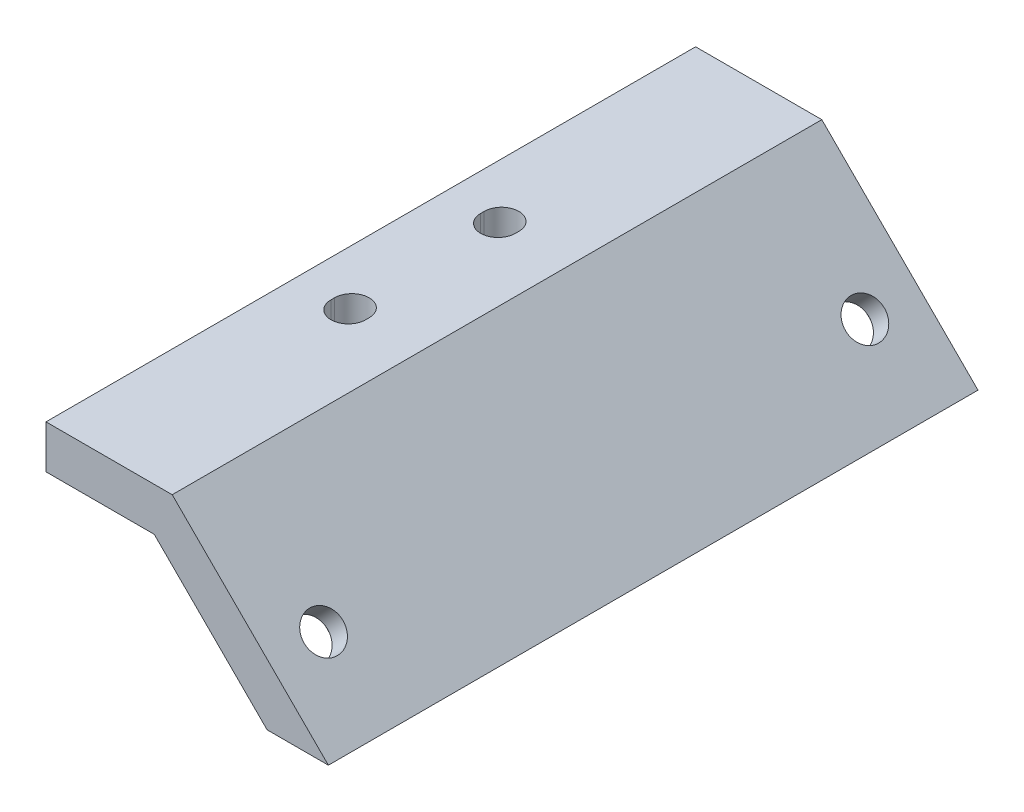
ISO-10303-21;
HEADER;
FILE_DESCRIPTION(('STEP AP214'),'2;1');
FILE_NAME('part.step','',(''),(''),'','','');
FILE_SCHEMA(('AUTOMOTIVE_DESIGN { 1 0 10303 214 1 1 1 1 }'));
ENDSEC;
DATA;
#1=APPLICATION_CONTEXT('core data for automotive mechanical design processes');
#2=APPLICATION_PROTOCOL_DEFINITION('international standard','automotive_design',2000,#1);
#3=PRODUCT_CONTEXT('',#1,'mechanical');
#4=PRODUCT('Part','Part','',(#3));
#5=PRODUCT_RELATED_PRODUCT_CATEGORY('part','',(#4));
#6=PRODUCT_DEFINITION_FORMATION('','',#4);
#7=PRODUCT_DEFINITION_CONTEXT('part definition',#1,'design');
#8=PRODUCT_DEFINITION('design','',#6,#7);
#9=PRODUCT_DEFINITION_SHAPE('','',#8);
#10=(LENGTH_UNIT() NAMED_UNIT(*) SI_UNIT(.MILLI.,.METRE.));
#11=(NAMED_UNIT(*) PLANE_ANGLE_UNIT() SI_UNIT($,.RADIAN.));
#12=(NAMED_UNIT(*) SI_UNIT($,.STERADIAN.) SOLID_ANGLE_UNIT());
#13=UNCERTAINTY_MEASURE_WITH_UNIT(LENGTH_MEASURE(1.E-05),#10,'distance_accuracy_value','');
#14=(GEOMETRIC_REPRESENTATION_CONTEXT(3) GLOBAL_UNCERTAINTY_ASSIGNED_CONTEXT((#13)) GLOBAL_UNIT_ASSIGNED_CONTEXT((#10,
#11,#12)) REPRESENTATION_CONTEXT('',''));
#15=CARTESIAN_POINT('',(0.,0.,0.));
#16=DIRECTION('',(0.,0.,1.));
#17=DIRECTION('',(1.,0.,0.));
#18=AXIS2_PLACEMENT_3D('',#15,#16,#17);
#19=CARTESIAN_POINT('',(-1.84694659665228,9.04694659665227,-25.));
#20=DIRECTION('',(-0.707106781186547,-0.707106781186548,0.));
#21=DIRECTION('',(0.707106781186548,-0.707106781186547,0.));
#22=AXIS2_PLACEMENT_3D('',#19,#20,#21);
#23=CYLINDRICAL_SURFACE('',#22,1.8);
#24=CARTESIAN_POINT('',(-5.44694659665227,5.44694659665227,-25.));
#25=DIRECTION('',(0.707106781186547,0.707106781186548,0.));
#26=DIRECTION('',(-0.707106781186548,0.707106781186547,0.));
#27=AXIS2_PLACEMENT_3D('',#24,#25,#26);
#28=CIRCLE('',#27,1.8);
#29=CARTESIAN_POINT('',(-6.71973880278806,6.71973880278805,-25.));
#30=VERTEX_POINT('',#29);
#31=EDGE_CURVE('E207',#30,#30,#28,.F.);
#32=ORIENTED_EDGE('',*,*,#31,.F.);
#33=EDGE_LOOP('',(#32));
#34=FACE_BOUND('',#33,.T.);
#35=CARTESIAN_POINT('',(-6.86116015902537,4.03273303427917,-25.));
#36=DIRECTION('',(-0.707106781186547,-0.707106781186548,0.));
#37=DIRECTION('',(0.707106781186548,-0.707106781186547,0.));
#38=AXIS2_PLACEMENT_3D('',#35,#36,#37);
#39=CIRCLE('',#38,1.8);
#40=CARTESIAN_POINT('',(-5.58836795288958,2.75994082814339,-25.));
#41=VERTEX_POINT('',#40);
#42=EDGE_CURVE('E199',#41,#41,#39,.T.);
#43=ORIENTED_EDGE('',*,*,#42,.T.);
#44=EDGE_LOOP('',(#43));
#45=FACE_BOUND('',#44,.T.);
#46=ADVANCED_FACE('F33',(#34,#45),#23,.F.);
#47=CARTESIAN_POINT('',(-1.84694659665229,9.04694659665228,25.));
#48=DIRECTION('',(-0.707106781186547,-0.707106781186548,0.));
#49=DIRECTION('',(0.707106781186548,-0.707106781186547,0.));
#50=AXIS2_PLACEMENT_3D('',#47,#48,#49);
#51=CYLINDRICAL_SURFACE('',#50,1.8);
#52=CARTESIAN_POINT('',(-5.44694659665228,5.44694659665228,25.));
#53=DIRECTION('',(0.707106781186547,0.707106781186548,0.));
#54=DIRECTION('',(-0.707106781186548,0.707106781186547,0.));
#55=AXIS2_PLACEMENT_3D('',#52,#53,#54);
#56=CIRCLE('',#55,1.8);
#57=CARTESIAN_POINT('',(-6.71973880278807,6.71973880278806,25.));
#58=VERTEX_POINT('',#57);
#59=EDGE_CURVE('E217',#58,#58,#56,.F.);
#60=ORIENTED_EDGE('',*,*,#59,.F.);
#61=EDGE_LOOP('',(#60));
#62=FACE_BOUND('',#61,.T.);
#63=CARTESIAN_POINT('',(-6.86116015902538,4.03273303427918,25.));
#64=DIRECTION('',(-0.707106781186547,-0.707106781186548,0.));
#65=DIRECTION('',(0.707106781186548,-0.707106781186547,0.));
#66=AXIS2_PLACEMENT_3D('',#63,#64,#65);
#67=CIRCLE('',#66,1.8);
#68=CARTESIAN_POINT('',(-5.58836795288959,2.7599408281434,25.));
#69=VERTEX_POINT('',#68);
#70=EDGE_CURVE('E163',#69,#69,#67,.T.);
#71=ORIENTED_EDGE('',*,*,#70,.T.);
#72=EDGE_LOOP('',(#71));
#73=FACE_BOUND('',#72,.T.);
#74=ADVANCED_FACE('F299',(#62,#73),#51,.F.);
#75=CARTESIAN_POINT('',(-5.65685424949238,0.,-30.));
#76=DIRECTION('',(0.,-1.,0.));
#77=DIRECTION('',(1.,0.,0.));
#78=AXIS2_PLACEMENT_3D('',#75,#76,#77);
#79=PLANE('',#78);
#80=DIRECTION('',(0.,0.,1.));
#81=VECTOR('',#80,1.);
#82=CARTESIAN_POINT('',(0.,0.,-30.));
#83=LINE('',#82,#81);
#84=CARTESIAN_POINT('',(0.,0.,-30.));
#85=VERTEX_POINT('',#84);
#86=CARTESIAN_POINT('',(0.,0.,30.));
#87=VERTEX_POINT('',#86);
#88=EDGE_CURVE('E37',#85,#87,#83,.T.);
#89=ORIENTED_EDGE('',*,*,#88,.T.);
#90=DIRECTION('',(1.,0.,0.));
#91=VECTOR('',#90,1.);
#92=CARTESIAN_POINT('',(-5.65685424949238,0.,30.));
#93=LINE('',#92,#91);
#94=CARTESIAN_POINT('',(-5.65685424949238,0.,30.));
#95=VERTEX_POINT('',#94);
#96=EDGE_CURVE('E220',#95,#87,#93,.T.);
#97=ORIENTED_EDGE('',*,*,#96,.F.);
#98=DIRECTION('',(0.,0.,1.));
#99=VECTOR('',#98,1.);
#100=CARTESIAN_POINT('',(-5.65685424949238,0.,-30.));
#101=LINE('',#100,#99);
#102=CARTESIAN_POINT('',(-5.65685424949238,0.,-30.));
#103=VERTEX_POINT('',#102);
#104=EDGE_CURVE('E11',#103,#95,#101,.T.);
#105=ORIENTED_EDGE('',*,*,#104,.F.);
#106=DIRECTION('',(1.,0.,0.));
#107=VECTOR('',#106,1.);
#108=CARTESIAN_POINT('',(-5.65685424949238,0.,-30.));
#109=LINE('',#108,#107);
#110=EDGE_CURVE('E240',#103,#85,#109,.T.);
#111=ORIENTED_EDGE('',*,*,#110,.T.);
#112=EDGE_LOOP('',(#89,#97,#105,#111));
#113=FACE_BOUND('',#112,.T.);
#114=ADVANCED_FACE('F35',(#113),#79,.T.);
#115=CARTESIAN_POINT('',(-16.081832585698,10.4249783362056,-30.));
#116=DIRECTION('',(-0.707106781186547,-0.707106781186548,0.));
#117=DIRECTION('',(0.707106781186548,-0.707106781186547,0.));
#118=AXIS2_PLACEMENT_3D('',#115,#116,#117);
#119=PLANE('',#118);
#120=CARTESIAN_POINT('',(-8.27537372139846,2.61851947190608,-25.));
#121=DIRECTION('',(-0.707106781186547,-0.707106781186548,0.));
#122=DIRECTION('',(0.707106781186548,-0.707106781186547,0.));
#123=AXIS2_PLACEMENT_3D('',#120,#121,#122);
#124=CIRCLE('',#123,3.2);
#125=CARTESIAN_POINT('',(-6.01263202160151,0.355777772109124,-25.));
#126=VERTEX_POINT('',#125);
#127=EDGE_CURVE('E202',#126,#126,#124,.T.);
#128=ORIENTED_EDGE('',*,*,#127,.F.);
#129=EDGE_LOOP('',(#128));
#130=FACE_BOUND('',#129,.T.);
#131=CARTESIAN_POINT('',(-8.27537372139847,2.61851947190609,25.));
#132=DIRECTION('',(-0.707106781186547,-0.707106781186548,0.));
#133=DIRECTION('',(0.707106781186548,-0.707106781186547,0.));
#134=AXIS2_PLACEMENT_3D('',#131,#132,#133);
#135=CIRCLE('',#134,3.2);
#136=CARTESIAN_POINT('',(-6.01263202160152,0.355777772109136,25.));
#137=VERTEX_POINT('',#136);
#138=EDGE_CURVE('E212',#137,#137,#135,.T.);
#139=ORIENTED_EDGE('',*,*,#138,.F.);
#140=EDGE_LOOP('',(#139));
#141=FACE_BOUND('',#140,.T.);
#142=ORIENTED_EDGE('',*,*,#104,.T.);
#143=DIRECTION('',(0.707106781186548,-0.707106781186547,0.));
#144=VECTOR('',#143,1.);
#145=CARTESIAN_POINT('',(-16.081832585698,10.4249783362056,30.));
#146=LINE('',#145,#144);
#147=CARTESIAN_POINT('',(-16.081832585698,10.4249783362056,30.));
#148=VERTEX_POINT('',#147);
#149=EDGE_CURVE('E237',#148,#95,#146,.T.);
#150=ORIENTED_EDGE('',*,*,#149,.F.);
#151=DIRECTION('',(0.,0.,1.));
#152=VECTOR('',#151,1.);
#153=CARTESIAN_POINT('',(-16.081832585698,10.4249783362056,-30.));
#154=LINE('',#153,#152);
#155=CARTESIAN_POINT('',(-16.081832585698,10.4249783362056,-30.));
#156=VERTEX_POINT('',#155);
#157=EDGE_CURVE('E42',#156,#148,#154,.T.);
#158=ORIENTED_EDGE('',*,*,#157,.F.);
#159=DIRECTION('',(0.707106781186548,-0.707106781186547,0.));
#160=VECTOR('',#159,1.);
#161=CARTESIAN_POINT('',(-16.081832585698,10.4249783362056,-30.));
#162=LINE('',#161,#160);
#163=EDGE_CURVE('E255',#156,#103,#162,.T.);
#164=ORIENTED_EDGE('',*,*,#163,.T.);
#165=EDGE_LOOP('',(#142,#150,#158,#164));
#166=FACE_BOUND('',#165,.T.);
#167=ADVANCED_FACE('F276',(#130,#141,#166),#119,.T.);
#168=CARTESIAN_POINT('',(-26.081832585698,10.4249783362056,-30.));
#169=DIRECTION('',(0.,-1.,0.));
#170=DIRECTION('',(0.,0.,-1.));
#171=AXIS2_PLACEMENT_3D('',#168,#169,#170);
#172=PLANE('',#171);
#173=CARTESIAN_POINT('',(-21.081832585698,10.4249783362056,-6.75));
#174=DIRECTION('',(0.,-1.,0.));
#175=DIRECTION('',(0.,0.,-1.));
#176=AXIS2_PLACEMENT_3D('',#173,#174,#175);
#177=CIRCLE('',#176,1.6);
#178=CARTESIAN_POINT('',(-22.681832585698,10.4249783362056,-6.75));
#179=VERTEX_POINT('',#178);
#180=CARTESIAN_POINT('',(-19.481832585698,10.4249783362056,-6.75));
#181=VERTEX_POINT('',#180);
#182=EDGE_CURVE('E146',#179,#181,#177,.F.);
#183=ORIENTED_EDGE('',*,*,#182,.T.);
#184=DIRECTION('',(0.,0.,1.));
#185=VECTOR('',#184,1.);
#186=CARTESIAN_POINT('',(-19.4818325856981,10.4249783362056,-2.07972875947462E-13));
#187=LINE('',#186,#185);
#188=CARTESIAN_POINT('',(-19.481832585698,10.4249783362056,-7.07499999999998));
#189=VERTEX_POINT('',#188);
#190=EDGE_CURVE('E162',#189,#181,#187,.T.);
#191=ORIENTED_EDGE('',*,*,#190,.F.);
#192=CARTESIAN_POINT('',(-21.081832585698,10.4249783362056,-7.075));
#193=DIRECTION('',(0.,-1.,0.));
#194=DIRECTION('',(0.,0.,-1.));
#195=AXIS2_PLACEMENT_3D('',#192,#193,#194);
#196=CIRCLE('',#195,1.6);
#197=CARTESIAN_POINT('',(-22.681832585698,10.4249783362056,-7.07500000000001));
#198=VERTEX_POINT('',#197);
#199=EDGE_CURVE('E50',#189,#198,#196,.F.);
#200=ORIENTED_EDGE('',*,*,#199,.T.);
#201=DIRECTION('',(0.,0.,1.));
#202=VECTOR('',#201,1.);
#203=CARTESIAN_POINT('',(-22.6818325856981,10.4249783362056,-2.42133584397444E-13));
#204=LINE('',#203,#202);
#205=EDGE_CURVE('E139',#198,#179,#204,.T.);
#206=ORIENTED_EDGE('',*,*,#205,.T.);
#207=EDGE_LOOP('',(#183,#191,#200,#206));
#208=FACE_BOUND('',#207,.T.);
#209=CARTESIAN_POINT('',(-21.081832585698,10.4249783362056,7.075));
#210=DIRECTION('',(0.,-1.,0.));
#211=DIRECTION('',(0.,0.,-1.));
#212=AXIS2_PLACEMENT_3D('',#209,#210,#211);
#213=CIRCLE('',#212,1.6);
#214=CARTESIAN_POINT('',(-22.681832585698,10.4249783362056,7.07500000000001));
#215=VERTEX_POINT('',#214);
#216=CARTESIAN_POINT('',(-19.481832585698,10.4249783362056,7.07499999999998));
#217=VERTEX_POINT('',#216);
#218=EDGE_CURVE('E172',#215,#217,#213,.F.);
#219=ORIENTED_EDGE('',*,*,#218,.T.);
#220=DIRECTION('',(0.,0.,-1.));
#221=VECTOR('',#220,1.);
#222=CARTESIAN_POINT('',(-19.481832585698,10.4249783362056,2.07972875947462E-13));
#223=LINE('',#222,#221);
#224=CARTESIAN_POINT('',(-19.481832585698,10.4249783362056,6.75));
#225=VERTEX_POINT('',#224);
#226=EDGE_CURVE('E191',#217,#225,#223,.T.);
#227=ORIENTED_EDGE('',*,*,#226,.T.);
#228=CARTESIAN_POINT('',(-21.081832585698,10.4249783362056,6.75));
#229=DIRECTION('',(0.,-1.,0.));
#230=DIRECTION('',(0.,0.,-1.));
#231=AXIS2_PLACEMENT_3D('',#228,#229,#230);
#232=CIRCLE('',#231,1.6);
#233=CARTESIAN_POINT('',(-22.681832585698,10.4249783362056,6.75));
#234=VERTEX_POINT('',#233);
#235=EDGE_CURVE('E186',#225,#234,#232,.F.);
#236=ORIENTED_EDGE('',*,*,#235,.T.);
#237=DIRECTION('',(0.,0.,-1.));
#238=VECTOR('',#237,1.);
#239=CARTESIAN_POINT('',(-22.681832585698,10.4249783362056,2.42133584397444E-13));
#240=LINE('',#239,#238);
#241=EDGE_CURVE('E179',#215,#234,#240,.T.);
#242=ORIENTED_EDGE('',*,*,#241,.F.);
#243=EDGE_LOOP('',(#219,#227,#236,#242));
#244=FACE_BOUND('',#243,.T.);
#245=ORIENTED_EDGE('',*,*,#157,.T.);
#246=DIRECTION('',(1.,0.,0.));
#247=VECTOR('',#246,1.);
#248=CARTESIAN_POINT('',(-26.081832585698,10.4249783362056,30.));
#249=LINE('',#248,#247);
#250=CARTESIAN_POINT('',(-26.081832585698,10.4249783362056,30.));
#251=VERTEX_POINT('',#250);
#252=EDGE_CURVE('E234',#251,#148,#249,.T.);
#253=ORIENTED_EDGE('',*,*,#252,.F.);
#254=DIRECTION('',(0.,0.,1.));
#255=VECTOR('',#254,1.);
#256=CARTESIAN_POINT('',(-26.081832585698,10.4249783362056,-30.));
#257=LINE('',#256,#255);
#258=CARTESIAN_POINT('',(-26.081832585698,10.4249783362056,-30.));
#259=VERTEX_POINT('',#258);
#260=EDGE_CURVE('E259',#259,#251,#257,.T.);
#261=ORIENTED_EDGE('',*,*,#260,.F.);
#262=DIRECTION('',(1.,0.,0.));
#263=VECTOR('',#262,1.);
#264=CARTESIAN_POINT('',(-26.081832585698,10.4249783362056,-30.));
#265=LINE('',#264,#263);
#266=EDGE_CURVE('E252',#259,#156,#265,.T.);
#267=ORIENTED_EDGE('',*,*,#266,.T.);
#268=EDGE_LOOP('',(#245,#253,#261,#267));
#269=FACE_BOUND('',#268,.T.);
#270=ADVANCED_FACE('F155',(#208,#244,#269),#172,.T.);
#271=CARTESIAN_POINT('',(-26.081832585698,14.4249783362056,-30.));
#272=DIRECTION('',(-1.,0.,0.));
#273=DIRECTION('',(0.,-1.,0.));
#274=AXIS2_PLACEMENT_3D('',#271,#272,#273);
#275=PLANE('',#274);
#276=ORIENTED_EDGE('',*,*,#260,.T.);
#277=DIRECTION('',(0.,-1.,0.));
#278=VECTOR('',#277,1.);
#279=CARTESIAN_POINT('',(-26.081832585698,14.4249783362056,30.));
#280=LINE('',#279,#278);
#281=CARTESIAN_POINT('',(-26.081832585698,14.4249783362056,30.));
#282=VERTEX_POINT('',#281);
#283=EDGE_CURVE('E231',#282,#251,#280,.T.);
#284=ORIENTED_EDGE('',*,*,#283,.F.);
#285=DIRECTION('',(0.,0.,1.));
#286=VECTOR('',#285,1.);
#287=CARTESIAN_POINT('',(-26.081832585698,14.4249783362056,-30.));
#288=LINE('',#287,#286);
#289=CARTESIAN_POINT('',(-26.081832585698,14.4249783362056,-30.));
#290=VERTEX_POINT('',#289);
#291=EDGE_CURVE('E261',#290,#282,#288,.T.);
#292=ORIENTED_EDGE('',*,*,#291,.F.);
#293=DIRECTION('',(0.,-1.,0.));
#294=VECTOR('',#293,1.);
#295=CARTESIAN_POINT('',(-26.081832585698,14.4249783362056,-30.));
#296=LINE('',#295,#294);
#297=EDGE_CURVE('E249',#290,#259,#296,.T.);
#298=ORIENTED_EDGE('',*,*,#297,.T.);
#299=EDGE_LOOP('',(#276,#284,#292,#298));
#300=FACE_BOUND('',#299,.T.);
#301=ADVANCED_FACE('F287',(#300),#275,.T.);
#302=CARTESIAN_POINT('',(-14.4249783362056,14.4249783362056,-30.));
#303=DIRECTION('',(0.,1.,0.));
#304=DIRECTION('',(-1.,0.,0.));
#305=AXIS2_PLACEMENT_3D('',#302,#303,#304);
#306=PLANE('',#305);
#307=CARTESIAN_POINT('',(-21.081832585698,14.4249783362056,-6.75));
#308=DIRECTION('',(0.,1.,0.));
#309=DIRECTION('',(-1.,0.,0.));
#310=AXIS2_PLACEMENT_3D('',#307,#308,#309);
#311=CIRCLE('',#310,1.6);
#312=CARTESIAN_POINT('',(-22.681832585698,14.4249783362056,-6.75));
#313=VERTEX_POINT('',#312);
#314=CARTESIAN_POINT('',(-19.481832585698,14.4249783362056,-6.75));
#315=VERTEX_POINT('',#314);
#316=EDGE_CURVE('E382',#313,#315,#311,.T.);
#317=ORIENTED_EDGE('',*,*,#316,.F.);
#318=DIRECTION('',(0.,0.,1.));
#319=VECTOR('',#318,1.);
#320=CARTESIAN_POINT('',(-22.6818325856981,14.4249783362056,-2.42133584397444E-13));
#321=LINE('',#320,#319);
#322=CARTESIAN_POINT('',(-22.681832585698,14.4249783362056,-7.07500000000001));
#323=VERTEX_POINT('',#322);
#324=EDGE_CURVE('E141',#323,#313,#321,.T.);
#325=ORIENTED_EDGE('',*,*,#324,.F.);
#326=CARTESIAN_POINT('',(-21.081832585698,14.4249783362056,-7.075));
#327=DIRECTION('',(0.,1.,0.));
#328=DIRECTION('',(-1.,0.,0.));
#329=AXIS2_PLACEMENT_3D('',#326,#327,#328);
#330=CIRCLE('',#329,1.6);
#331=CARTESIAN_POINT('',(-19.481832585698,14.4249783362056,-7.07499999999998));
#332=VERTEX_POINT('',#331);
#333=EDGE_CURVE('E381',#332,#323,#330,.T.);
#334=ORIENTED_EDGE('',*,*,#333,.F.);
#335=DIRECTION('',(0.,0.,1.));
#336=VECTOR('',#335,1.);
#337=CARTESIAN_POINT('',(-19.4818325856981,14.4249783362056,-2.07972875947462E-13));
#338=LINE('',#337,#336);
#339=EDGE_CURVE('E168',#332,#315,#338,.T.);
#340=ORIENTED_EDGE('',*,*,#339,.T.);
#341=EDGE_LOOP('',(#317,#325,#334,#340));
#342=FACE_BOUND('',#341,.T.);
#343=CARTESIAN_POINT('',(-21.081832585698,14.4249783362056,7.075));
#344=DIRECTION('',(0.,1.,0.));
#345=DIRECTION('',(-1.,0.,0.));
#346=AXIS2_PLACEMENT_3D('',#343,#344,#345);
#347=CIRCLE('',#346,1.6);
#348=CARTESIAN_POINT('',(-22.681832585698,14.4249783362056,7.07500000000001));
#349=VERTEX_POINT('',#348);
#350=CARTESIAN_POINT('',(-19.481832585698,14.4249783362056,7.07499999999998));
#351=VERTEX_POINT('',#350);
#352=EDGE_CURVE('E176',#349,#351,#347,.T.);
#353=ORIENTED_EDGE('',*,*,#352,.F.);
#354=DIRECTION('',(0.,0.,-1.));
#355=VECTOR('',#354,1.);
#356=CARTESIAN_POINT('',(-22.681832585698,14.4249783362056,2.42133584397444E-13));
#357=LINE('',#356,#355);
#358=CARTESIAN_POINT('',(-22.681832585698,14.4249783362056,6.75));
#359=VERTEX_POINT('',#358);
#360=EDGE_CURVE('E153',#349,#359,#357,.T.);
#361=ORIENTED_EDGE('',*,*,#360,.T.);
#362=CARTESIAN_POINT('',(-21.081832585698,14.4249783362056,6.75));
#363=DIRECTION('',(0.,1.,0.));
#364=DIRECTION('',(-1.,0.,0.));
#365=AXIS2_PLACEMENT_3D('',#362,#363,#364);
#366=CIRCLE('',#365,1.6);
#367=CARTESIAN_POINT('',(-19.481832585698,14.4249783362056,6.75));
#368=VERTEX_POINT('',#367);
#369=EDGE_CURVE('E170',#368,#359,#366,.T.);
#370=ORIENTED_EDGE('',*,*,#369,.F.);
#371=DIRECTION('',(0.,0.,-1.));
#372=VECTOR('',#371,1.);
#373=CARTESIAN_POINT('',(-19.481832585698,14.4249783362056,2.07972875947462E-13));
#374=LINE('',#373,#372);
#375=EDGE_CURVE('E173',#351,#368,#374,.T.);
#376=ORIENTED_EDGE('',*,*,#375,.F.);
#377=EDGE_LOOP('',(#353,#361,#370,#376));
#378=FACE_BOUND('',#377,.T.);
#379=ORIENTED_EDGE('',*,*,#291,.T.);
#380=DIRECTION('',(-1.,0.,0.));
#381=VECTOR('',#380,1.);
#382=CARTESIAN_POINT('',(-14.4249783362056,14.4249783362056,30.));
#383=LINE('',#382,#381);
#384=CARTESIAN_POINT('',(-14.4249783362056,14.4249783362056,30.));
#385=VERTEX_POINT('',#384);
#386=EDGE_CURVE('E228',#385,#282,#383,.T.);
#387=ORIENTED_EDGE('',*,*,#386,.F.);
#388=DIRECTION('',(0.,0.,1.));
#389=VECTOR('',#388,1.);
#390=CARTESIAN_POINT('',(-14.4249783362056,14.4249783362056,-30.));
#391=LINE('',#390,#389);
#392=CARTESIAN_POINT('',(-14.4249783362056,14.4249783362056,-30.));
#393=VERTEX_POINT('',#392);
#394=EDGE_CURVE('E262',#393,#385,#391,.T.);
#395=ORIENTED_EDGE('',*,*,#394,.F.);
#396=DIRECTION('',(-1.,0.,0.));
#397=VECTOR('',#396,1.);
#398=CARTESIAN_POINT('',(-14.4249783362056,14.4249783362056,-30.));
#399=LINE('',#398,#397);
#400=EDGE_CURVE('E246',#393,#290,#399,.T.);
#401=ORIENTED_EDGE('',*,*,#400,.T.);
#402=EDGE_LOOP('',(#379,#387,#395,#401));
#403=FACE_BOUND('',#402,.T.);
#404=ADVANCED_FACE('F284',(#342,#378,#403),#306,.T.);
#405=CARTESIAN_POINT('',(0.,0.,-30.));
#406=DIRECTION('',(0.707106781186547,0.707106781186548,0.));
#407=DIRECTION('',(-0.707106781186548,0.707106781186547,0.));
#408=AXIS2_PLACEMENT_3D('',#405,#406,#407);
#409=PLANE('',#408);
#410=ORIENTED_EDGE('',*,*,#59,.T.);
#411=EDGE_LOOP('',(#410));
#412=FACE_BOUND('',#411,.T.);
#413=ORIENTED_EDGE('',*,*,#31,.T.);
#414=EDGE_LOOP('',(#413));
#415=FACE_BOUND('',#414,.T.);
#416=ORIENTED_EDGE('',*,*,#394,.T.);
#417=DIRECTION('',(-0.707106781186548,0.707106781186547,0.));
#418=VECTOR('',#417,1.);
#419=CARTESIAN_POINT('',(0.,0.,30.));
#420=LINE('',#419,#418);
#421=EDGE_CURVE('E225',#87,#385,#420,.T.);
#422=ORIENTED_EDGE('',*,*,#421,.F.);
#423=ORIENTED_EDGE('',*,*,#88,.F.);
#424=DIRECTION('',(-0.707106781186548,0.707106781186547,0.));
#425=VECTOR('',#424,1.);
#426=CARTESIAN_POINT('',(0.,0.,-30.));
#427=LINE('',#426,#425);
#428=EDGE_CURVE('E243',#85,#393,#427,.T.);
#429=ORIENTED_EDGE('',*,*,#428,.T.);
#430=EDGE_LOOP('',(#416,#422,#423,#429));
#431=FACE_BOUND('',#430,.T.);
#432=ADVANCED_FACE('F269',(#412,#415,#431),#409,.T.);
#433=CARTESIAN_POINT('',(0.,0.,-30.));
#434=DIRECTION('',(0.,0.,-1.));
#435=DIRECTION('',(-1.,0.,0.));
#436=AXIS2_PLACEMENT_3D('',#433,#434,#435);
#437=PLANE('',#436);
#438=ORIENTED_EDGE('',*,*,#110,.F.);
#439=ORIENTED_EDGE('',*,*,#163,.F.);
#440=ORIENTED_EDGE('',*,*,#266,.F.);
#441=ORIENTED_EDGE('',*,*,#297,.F.);
#442=ORIENTED_EDGE('',*,*,#400,.F.);
#443=ORIENTED_EDGE('',*,*,#428,.F.);
#444=EDGE_LOOP('',(#438,#439,#440,#441,#442,#443));
#445=FACE_BOUND('',#444,.T.);
#446=ADVANCED_FACE('F279',(#445),#437,.T.);
#447=CARTESIAN_POINT('',(0.,0.,30.));
#448=DIRECTION('',(0.,0.,-1.));
#449=DIRECTION('',(-1.,0.,0.));
#450=AXIS2_PLACEMENT_3D('',#447,#448,#449);
#451=PLANE('',#450);
#452=ORIENTED_EDGE('',*,*,#96,.T.);
#453=ORIENTED_EDGE('',*,*,#421,.T.);
#454=ORIENTED_EDGE('',*,*,#386,.T.);
#455=ORIENTED_EDGE('',*,*,#283,.T.);
#456=ORIENTED_EDGE('',*,*,#252,.T.);
#457=ORIENTED_EDGE('',*,*,#149,.T.);
#458=EDGE_LOOP('',(#452,#453,#454,#455,#456,#457));
#459=FACE_BOUND('',#458,.T.);
#460=ADVANCED_FACE('F272',(#459),#451,.F.);
#461=CARTESIAN_POINT('',(-6.86116015902538,4.03273303427918,25.));
#462=DIRECTION('',(-0.707106781186547,-0.707106781186548,0.));
#463=DIRECTION('',(0.707106781186548,-0.707106781186547,0.));
#464=AXIS2_PLACEMENT_3D('',#461,#462,#463);
#465=CYLINDRICAL_SURFACE('',#464,3.2);
#466=CARTESIAN_POINT('',(-6.86116015902538,4.03273303427918,25.));
#467=DIRECTION('',(-0.707106781186547,-0.707106781186548,0.));
#468=DIRECTION('',(0.707106781186548,-0.707106781186547,0.));
#469=AXIS2_PLACEMENT_3D('',#466,#467,#468);
#470=CIRCLE('',#469,3.2);
#471=CARTESIAN_POINT('',(-4.59841845922842,1.76999133448223,25.));
#472=VERTEX_POINT('',#471);
#473=EDGE_CURVE('E203',#472,#472,#470,.T.);
#474=ORIENTED_EDGE('',*,*,#473,.F.);
#475=EDGE_LOOP('',(#474));
#476=FACE_BOUND('',#475,.T.);
#477=ORIENTED_EDGE('',*,*,#138,.T.);
#478=EDGE_LOOP('',(#477));
#479=FACE_BOUND('',#478,.T.);
#480=ADVANCED_FACE('F313',(#476,#479),#465,.F.);
#481=CARTESIAN_POINT('',(-6.86116015902538,4.03273303427918,25.));
#482=DIRECTION('',(-0.707106781186547,-0.707106781186548,0.));
#483=DIRECTION('',(0.707106781186548,-0.707106781186547,0.));
#484=AXIS2_PLACEMENT_3D('',#481,#482,#483);
#485=PLANE('',#484);
#486=ORIENTED_EDGE('',*,*,#70,.F.);
#487=EDGE_LOOP('',(#486));
#488=FACE_BOUND('',#487,.T.);
#489=ORIENTED_EDGE('',*,*,#473,.T.);
#490=EDGE_LOOP('',(#489));
#491=FACE_BOUND('',#490,.T.);
#492=ADVANCED_FACE('F329',(#488,#491),#485,.T.);
#493=CARTESIAN_POINT('',(-6.86116015902537,4.03273303427917,-25.));
#494=DIRECTION('',(-0.707106781186547,-0.707106781186548,0.));
#495=DIRECTION('',(0.707106781186548,-0.707106781186547,0.));
#496=AXIS2_PLACEMENT_3D('',#493,#494,#495);
#497=CYLINDRICAL_SURFACE('',#496,3.2);
#498=CARTESIAN_POINT('',(-6.86116015902537,4.03273303427917,-25.));
#499=DIRECTION('',(-0.707106781186547,-0.707106781186548,0.));
#500=DIRECTION('',(0.707106781186548,-0.707106781186547,0.));
#501=AXIS2_PLACEMENT_3D('',#498,#499,#500);
#502=CIRCLE('',#501,3.2);
#503=CARTESIAN_POINT('',(-4.59841845922841,1.76999133448222,-25.));
#504=VERTEX_POINT('',#503);
#505=EDGE_CURVE('E204',#504,#504,#502,.T.);
#506=ORIENTED_EDGE('',*,*,#505,.F.);
#507=EDGE_LOOP('',(#506));
#508=FACE_BOUND('',#507,.T.);
#509=ORIENTED_EDGE('',*,*,#127,.T.);
#510=EDGE_LOOP('',(#509));
#511=FACE_BOUND('',#510,.T.);
#512=ADVANCED_FACE('F332',(#508,#511),#497,.F.);
#513=CARTESIAN_POINT('',(-6.86116015902537,4.03273303427917,-25.));
#514=DIRECTION('',(-0.707106781186547,-0.707106781186548,0.));
#515=DIRECTION('',(0.707106781186548,-0.707106781186547,0.));
#516=AXIS2_PLACEMENT_3D('',#513,#514,#515);
#517=PLANE('',#516);
#518=ORIENTED_EDGE('',*,*,#42,.F.);
#519=EDGE_LOOP('',(#518));
#520=FACE_BOUND('',#519,.T.);
#521=ORIENTED_EDGE('',*,*,#505,.T.);
#522=EDGE_LOOP('',(#521));
#523=FACE_BOUND('',#522,.T.);
#524=ADVANCED_FACE('F345',(#520,#523),#517,.T.);
#525=CARTESIAN_POINT('',(-21.081832585698,5.66413544864878,7.075));
#526=DIRECTION('',(0.,1.,0.));
#527=DIRECTION('',(-1.,0.,0.));
#528=AXIS2_PLACEMENT_3D('',#525,#526,#527);
#529=CYLINDRICAL_SURFACE('',#528,1.6);
#530=DIRECTION('',(0.,1.,0.));
#531=VECTOR('',#530,1.);
#532=CARTESIAN_POINT('',(-22.681832585698,5.66413544864878,7.07500000000001));
#533=LINE('',#532,#531);
#534=EDGE_CURVE('E58',#215,#349,#533,.T.);
#535=ORIENTED_EDGE('',*,*,#534,.T.);
#536=ORIENTED_EDGE('',*,*,#352,.T.);
#537=DIRECTION('',(0.,1.,0.));
#538=VECTOR('',#537,1.);
#539=CARTESIAN_POINT('',(-19.481832585698,5.66413544864878,7.07499999999998));
#540=LINE('',#539,#538);
#541=EDGE_CURVE('E184',#217,#351,#540,.T.);
#542=ORIENTED_EDGE('',*,*,#541,.F.);
#543=ORIENTED_EDGE('',*,*,#218,.F.);
#544=EDGE_LOOP('',(#535,#536,#542,#543));
#545=FACE_BOUND('',#544,.T.);
#546=ADVANCED_FACE('F349',(#545),#529,.F.);
#547=CARTESIAN_POINT('',(-19.481832585698,5.66413544864878,2.07972875947462E-13));
#548=DIRECTION('',(1.,0.,0.));
#549=DIRECTION('',(0.,0.,-1.));
#550=AXIS2_PLACEMENT_3D('',#547,#548,#549);
#551=PLANE('',#550);
#552=ORIENTED_EDGE('',*,*,#541,.T.);
#553=ORIENTED_EDGE('',*,*,#375,.T.);
#554=DIRECTION('',(0.,1.,0.));
#555=VECTOR('',#554,1.);
#556=CARTESIAN_POINT('',(-19.481832585698,5.66413544864878,6.75));
#557=LINE('',#556,#555);
#558=EDGE_CURVE('E190',#225,#368,#557,.T.);
#559=ORIENTED_EDGE('',*,*,#558,.F.);
#560=ORIENTED_EDGE('',*,*,#226,.F.);
#561=EDGE_LOOP('',(#552,#553,#559,#560));
#562=FACE_BOUND('',#561,.T.);
#563=ADVANCED_FACE('F353',(#562),#551,.F.);
#564=CARTESIAN_POINT('',(-21.081832585698,5.66413544864878,6.75));
#565=DIRECTION('',(0.,1.,0.));
#566=DIRECTION('',(-1.,0.,0.));
#567=AXIS2_PLACEMENT_3D('',#564,#565,#566);
#568=CYLINDRICAL_SURFACE('',#567,1.6);
#569=ORIENTED_EDGE('',*,*,#558,.T.);
#570=ORIENTED_EDGE('',*,*,#369,.T.);
#571=DIRECTION('',(0.,1.,0.));
#572=VECTOR('',#571,1.);
#573=CARTESIAN_POINT('',(-22.681832585698,5.66413544864878,6.75));
#574=LINE('',#573,#572);
#575=EDGE_CURVE('E189',#234,#359,#574,.T.);
#576=ORIENTED_EDGE('',*,*,#575,.F.);
#577=ORIENTED_EDGE('',*,*,#235,.F.);
#578=EDGE_LOOP('',(#569,#570,#576,#577));
#579=FACE_BOUND('',#578,.T.);
#580=ADVANCED_FACE('F357',(#579),#568,.F.);
#581=CARTESIAN_POINT('',(-22.681832585698,5.66413544864878,2.42133584397444E-13));
#582=DIRECTION('',(1.,0.,0.));
#583=DIRECTION('',(0.,0.,-1.));
#584=AXIS2_PLACEMENT_3D('',#581,#582,#583);
#585=PLANE('',#584);
#586=ORIENTED_EDGE('',*,*,#241,.T.);
#587=ORIENTED_EDGE('',*,*,#575,.T.);
#588=ORIENTED_EDGE('',*,*,#360,.F.);
#589=ORIENTED_EDGE('',*,*,#534,.F.);
#590=EDGE_LOOP('',(#586,#587,#588,#589));
#591=FACE_BOUND('',#590,.T.);
#592=ADVANCED_FACE('F361',(#591),#585,.T.);
#593=CARTESIAN_POINT('',(-21.081832585698,5.66413544864878,-6.75));
#594=DIRECTION('',(0.,1.,0.));
#595=DIRECTION('',(-1.,0.,0.));
#596=AXIS2_PLACEMENT_3D('',#593,#594,#595);
#597=CYLINDRICAL_SURFACE('',#596,1.6);
#598=DIRECTION('',(0.,1.,0.));
#599=VECTOR('',#598,1.);
#600=CARTESIAN_POINT('',(-22.681832585698,5.66413544864878,-6.75));
#601=LINE('',#600,#599);
#602=EDGE_CURVE('E135',#179,#313,#601,.T.);
#603=ORIENTED_EDGE('',*,*,#602,.T.);
#604=ORIENTED_EDGE('',*,*,#316,.T.);
#605=DIRECTION('',(0.,1.,0.));
#606=VECTOR('',#605,1.);
#607=CARTESIAN_POINT('',(-19.481832585698,5.66413544864878,-6.75));
#608=LINE('',#607,#606);
#609=EDGE_CURVE('E149',#181,#315,#608,.T.);
#610=ORIENTED_EDGE('',*,*,#609,.F.);
#611=ORIENTED_EDGE('',*,*,#182,.F.);
#612=EDGE_LOOP('',(#603,#604,#610,#611));
#613=FACE_BOUND('',#612,.T.);
#614=ADVANCED_FACE('F147',(#613),#597,.F.);
#615=CARTESIAN_POINT('',(-22.6818325856981,5.66413544864878,-2.42133584397444E-13));
#616=DIRECTION('',(-1.,0.,0.));
#617=DIRECTION('',(0.,0.,1.));
#618=AXIS2_PLACEMENT_3D('',#615,#616,#617);
#619=PLANE('',#618);
#620=DIRECTION('',(0.,1.,0.));
#621=VECTOR('',#620,1.);
#622=CARTESIAN_POINT('',(-22.681832585698,5.66413544864878,-7.07500000000001));
#623=LINE('',#622,#621);
#624=EDGE_CURVE('E165',#198,#323,#623,.T.);
#625=ORIENTED_EDGE('',*,*,#624,.T.);
#626=ORIENTED_EDGE('',*,*,#324,.T.);
#627=ORIENTED_EDGE('',*,*,#602,.F.);
#628=ORIENTED_EDGE('',*,*,#205,.F.);
#629=EDGE_LOOP('',(#625,#626,#627,#628));
#630=FACE_BOUND('',#629,.T.);
#631=ADVANCED_FACE('F137',(#630),#619,.F.);
#632=CARTESIAN_POINT('',(-21.081832585698,5.66413544864878,-7.075));
#633=DIRECTION('',(0.,1.,0.));
#634=DIRECTION('',(-1.,0.,0.));
#635=AXIS2_PLACEMENT_3D('',#632,#633,#634);
#636=CYLINDRICAL_SURFACE('',#635,1.6);
#637=DIRECTION('',(0.,1.,0.));
#638=VECTOR('',#637,1.);
#639=CARTESIAN_POINT('',(-19.481832585698,5.66413544864878,-7.07499999999998));
#640=LINE('',#639,#638);
#641=EDGE_CURVE('E167',#189,#332,#640,.T.);
#642=ORIENTED_EDGE('',*,*,#641,.T.);
#643=ORIENTED_EDGE('',*,*,#333,.T.);
#644=ORIENTED_EDGE('',*,*,#624,.F.);
#645=ORIENTED_EDGE('',*,*,#199,.F.);
#646=EDGE_LOOP('',(#642,#643,#644,#645));
#647=FACE_BOUND('',#646,.T.);
#648=ADVANCED_FACE('F369',(#647),#636,.F.);
#649=CARTESIAN_POINT('',(-19.4818325856981,5.66413544864878,-2.07972875947462E-13));
#650=DIRECTION('',(-1.,0.,0.));
#651=DIRECTION('',(0.,0.,1.));
#652=AXIS2_PLACEMENT_3D('',#649,#650,#651);
#653=PLANE('',#652);
#654=ORIENTED_EDGE('',*,*,#190,.T.);
#655=ORIENTED_EDGE('',*,*,#609,.T.);
#656=ORIENTED_EDGE('',*,*,#339,.F.);
#657=ORIENTED_EDGE('',*,*,#641,.F.);
#658=EDGE_LOOP('',(#654,#655,#656,#657));
#659=FACE_BOUND('',#658,.T.);
#660=ADVANCED_FACE('F372',(#659),#653,.T.);
#661=CLOSED_SHELL('',(#46,#74,#114,#167,#270,#301,#404,#432,#446,#460,#480,#492,#512,#524,#546,
#563,#580,#592,#614,#631,#648,#660));
#662=MANIFOLD_SOLID_BREP('B2',#661);
#663=ADVANCED_BREP_SHAPE_REPRESENTATION('',(#18,#662),#14);
#664=SHAPE_DEFINITION_REPRESENTATION(#9,#663);
ENDSEC;
END-ISO-10303-21;
